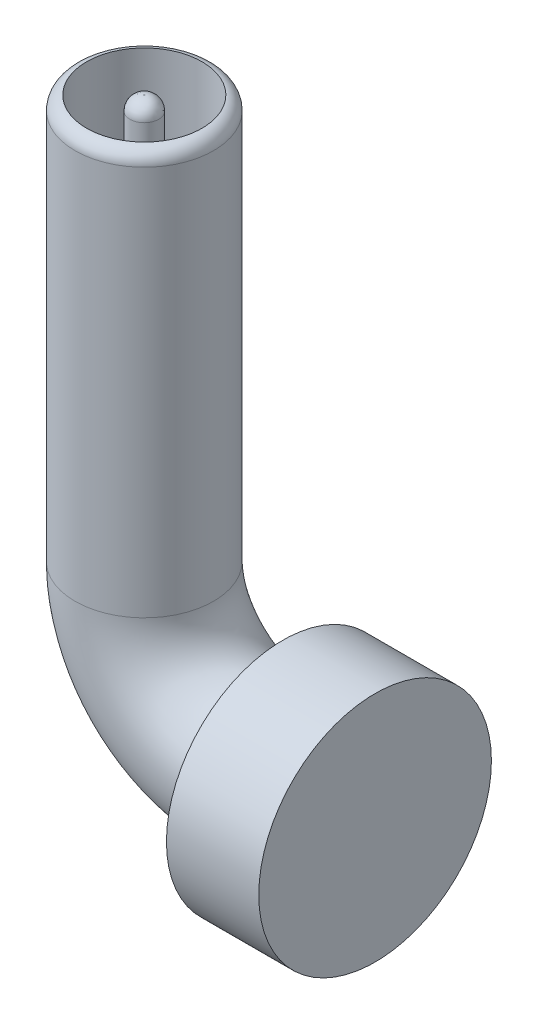
ISO-10303-21;
HEADER;
FILE_DESCRIPTION(('STEP AP214'),'2;1');
FILE_NAME('part.step','',(''),(''),'','','');
FILE_SCHEMA(('AUTOMOTIVE_DESIGN { 1 0 10303 214 1 1 1 1 }'));
ENDSEC;
DATA;
#1=APPLICATION_CONTEXT('core data for automotive mechanical design processes');
#2=APPLICATION_PROTOCOL_DEFINITION('international standard','automotive_design',2000,#1);
#3=PRODUCT_CONTEXT('',#1,'mechanical');
#4=PRODUCT('Part','Part','',(#3));
#5=PRODUCT_RELATED_PRODUCT_CATEGORY('part','',(#4));
#6=PRODUCT_DEFINITION_FORMATION('','',#4);
#7=PRODUCT_DEFINITION_CONTEXT('part definition',#1,'design');
#8=PRODUCT_DEFINITION('design','',#6,#7);
#9=PRODUCT_DEFINITION_SHAPE('','',#8);
#10=(LENGTH_UNIT() NAMED_UNIT(*) SI_UNIT(.MILLI.,.METRE.));
#11=(NAMED_UNIT(*) PLANE_ANGLE_UNIT() SI_UNIT($,.RADIAN.));
#12=(NAMED_UNIT(*) SI_UNIT($,.STERADIAN.) SOLID_ANGLE_UNIT());
#13=UNCERTAINTY_MEASURE_WITH_UNIT(LENGTH_MEASURE(1.E-05),#10,'distance_accuracy_value','');
#14=(GEOMETRIC_REPRESENTATION_CONTEXT(3) GLOBAL_UNCERTAINTY_ASSIGNED_CONTEXT((#13)) GLOBAL_UNIT_ASSIGNED_CONTEXT((#10,
#11,#12)) REPRESENTATION_CONTEXT('',''));
#15=CARTESIAN_POINT('',(0.,0.,0.));
#16=DIRECTION('',(0.,0.,1.));
#17=DIRECTION('',(1.,0.,0.));
#18=AXIS2_PLACEMENT_3D('',#15,#16,#17);
#19=CARTESIAN_POINT('',(-12.7,28.575,0.));
#20=DIRECTION('',(0.,-1.,0.));
#21=DIRECTION('',(1.,0.,0.));
#22=AXIS2_PLACEMENT_3D('',#19,#20,#21);
#23=PLANE('',#22);
#24=CARTESIAN_POINT('',(-12.7,28.575,0.));
#25=DIRECTION('',(0.,-1.,0.));
#26=DIRECTION('',(1.,0.,0.));
#27=AXIS2_PLACEMENT_3D('',#24,#25,#26);
#28=CIRCLE('',#27,0.0317500000000005);
#29=CARTESIAN_POINT('',(-12.66825,28.575,0.));
#30=VERTEX_POINT('',#29);
#31=CARTESIAN_POINT('',(-12.73175,28.575,0.));
#32=VERTEX_POINT('',#31);
#33=EDGE_CURVE('E34',#30,#32,#28,.T.);
#34=ORIENTED_EDGE('',*,*,#33,.F.);
#35=CARTESIAN_POINT('',(-12.7,28.575,0.));
#36=DIRECTION('',(0.,-1.,0.));
#37=DIRECTION('',(-1.,0.,0.));
#38=AXIS2_PLACEMENT_3D('',#35,#36,#37);
#39=CIRCLE('',#38,0.0317499999999953);
#40=EDGE_CURVE('E40',#32,#30,#39,.T.);
#41=ORIENTED_EDGE('',*,*,#40,.F.);
#42=EDGE_LOOP('',(#34,#41));
#43=FACE_BOUND('',#42,.T.);
#44=ADVANCED_FACE('F17',(#43),#23,.F.);
#45=CARTESIAN_POINT('',(-12.66825,27.813,0.));
#46=DIRECTION('',(0.,0.,1.));
#47=DIRECTION('',(1.,0.,0.));
#48=AXIS2_PLACEMENT_3D('',#45,#46,#47);
#49=CIRCLE('',#48,0.762);
#50=TRIMMED_CURVE('',#49,(PARAMETER_VALUE(-1.61247505921747)),
(PARAMETER_VALUE(1.61247505921747)),.T.,.PARAMETER.);
#51=CARTESIAN_POINT('',(-12.7,27.813,0.));
#52=DIRECTION('',(0.,-1.,0.));
#53=AXIS1_PLACEMENT('',#51,#52);
#54=SURFACE_OF_REVOLUTION('',#50,#53);
#55=ORIENTED_EDGE('',*,*,#33,.T.);
#56=ORIENTED_EDGE('',*,*,#40,.T.);
#57=EDGE_LOOP('',(#55,#56));
#58=FACE_BOUND('',#57,.T.);
#59=CARTESIAN_POINT('',(-12.7,27.813,0.));
#60=DIRECTION('',(0.,1.,0.));
#61=DIRECTION('',(-1.,0.,0.));
#62=AXIS2_PLACEMENT_3D('',#59,#60,#61);
#63=CIRCLE('',#62,0.793749999999999);
#64=CARTESIAN_POINT('',(-13.49375,27.813,0.));
#65=VERTEX_POINT('',#64);
#66=EDGE_CURVE('E44',#65,#65,#63,.F.);
#67=ORIENTED_EDGE('',*,*,#66,.F.);
#68=EDGE_LOOP('',(#67));
#69=FACE_BOUND('',#68,.T.);
#70=ADVANCED_FACE('F38',(#58,#69),#54,.F.);
#71=CARTESIAN_POINT('',(0.,0.,0.));
#72=DIRECTION('',(1.,0.,0.));
#73=DIRECTION('',(0.,0.,-1.));
#74=AXIS2_PLACEMENT_3D('',#71,#72,#73);
#75=PLANE('',#74);
#76=CARTESIAN_POINT('',(0.,0.,0.));
#77=DIRECTION('',(1.,0.,0.));
#78=DIRECTION('',(0.,0.,-1.));
#79=AXIS2_PLACEMENT_3D('',#76,#77,#78);
#80=CIRCLE('',#79,6.40181661571805);
#81=CARTESIAN_POINT('',(0.,0.,-6.40181661571805));
#82=VERTEX_POINT('',#81);
#83=EDGE_CURVE('E80',#82,#82,#80,.F.);
#84=ORIENTED_EDGE('',*,*,#83,.F.);
#85=EDGE_LOOP('',(#84));
#86=FACE_BOUND('',#85,.T.);
#87=ADVANCED_FACE('F71',(#86),#75,.T.);
#88=CARTESIAN_POINT('',(-12.7,15.875,0.));
#89=DIRECTION('',(0.,1.,0.));
#90=DIRECTION('',(-1.,0.,0.));
#91=AXIS2_PLACEMENT_3D('',#88,#89,#90);
#92=CYLINDRICAL_SURFACE('',#91,0.793749999999999);
#93=CARTESIAN_POINT('',(-12.7,15.875,0.));
#94=DIRECTION('',(0.,1.,0.));
#95=DIRECTION('',(-1.,0.,0.));
#96=AXIS2_PLACEMENT_3D('',#93,#94,#95);
#97=CIRCLE('',#96,0.793749999999999);
#98=CARTESIAN_POINT('',(-13.49375,15.875,0.));
#99=VERTEX_POINT('',#98);
#100=EDGE_CURVE('E84',#99,#99,#97,.F.);
#101=ORIENTED_EDGE('',*,*,#100,.F.);
#102=EDGE_LOOP('',(#101));
#103=FACE_BOUND('',#102,.T.);
#104=ORIENTED_EDGE('',*,*,#66,.T.);
#105=EDGE_LOOP('',(#104));
#106=FACE_BOUND('',#105,.T.);
#107=ADVANCED_FACE('F134',(#103,#106),#92,.T.);
#108=CARTESIAN_POINT('',(-5.08,0.,0.));
#109=DIRECTION('',(1.,0.,0.));
#110=DIRECTION('',(0.,0.,-1.));
#111=AXIS2_PLACEMENT_3D('',#108,#109,#110);
#112=CYLINDRICAL_SURFACE('',#111,6.40181661571805);
#113=ORIENTED_EDGE('',*,*,#83,.T.);
#114=EDGE_LOOP('',(#113));
#115=FACE_BOUND('',#114,.T.);
#116=CARTESIAN_POINT('',(-5.08,0.,0.));
#117=DIRECTION('',(1.,0.,0.));
#118=DIRECTION('',(0.,0.,-1.));
#119=AXIS2_PLACEMENT_3D('',#116,#117,#118);
#120=CIRCLE('',#119,6.40181661571805);
#121=CARTESIAN_POINT('',(-5.08,0.,-6.40181661571805));
#122=VERTEX_POINT('',#121);
#123=EDGE_CURVE('E88',#122,#122,#120,.T.);
#124=ORIENTED_EDGE('',*,*,#123,.T.);
#125=EDGE_LOOP('',(#124));
#126=FACE_BOUND('',#125,.T.);
#127=ADVANCED_FACE('F132',(#115,#126),#112,.T.);
#128=CARTESIAN_POINT('',(-12.7,15.875,0.));
#129=DIRECTION('',(0.,1.,0.));
#130=DIRECTION('',(-1.,0.,0.));
#131=AXIS2_PLACEMENT_3D('',#128,#129,#130);
#132=PLANE('',#131);
#133=CARTESIAN_POINT('',(-12.7,15.875,0.));
#134=DIRECTION('',(0.,1.,0.));
#135=DIRECTION('',(-1.,0.,0.));
#136=AXIS2_PLACEMENT_3D('',#133,#134,#135);
#137=CIRCLE('',#136,3.175);
#138=CARTESIAN_POINT('',(-15.875,15.875,0.));
#139=VERTEX_POINT('',#138);
#140=EDGE_CURVE('E92',#139,#139,#137,.T.);
#141=ORIENTED_EDGE('',*,*,#140,.T.);
#142=EDGE_LOOP('',(#141));
#143=FACE_BOUND('',#142,.T.);
#144=ORIENTED_EDGE('',*,*,#100,.T.);
#145=EDGE_LOOP('',(#144));
#146=FACE_BOUND('',#145,.T.);
#147=ADVANCED_FACE('F128',(#143,#146),#132,.T.);
#148=CARTESIAN_POINT('',(-5.08,0.,0.));
#149=DIRECTION('',(1.,0.,0.));
#150=DIRECTION('',(0.,0.,-1.));
#151=AXIS2_PLACEMENT_3D('',#148,#149,#150);
#152=PLANE('',#151);
#153=ORIENTED_EDGE('',*,*,#123,.F.);
#154=EDGE_LOOP('',(#153));
#155=FACE_BOUND('',#154,.T.);
#156=CARTESIAN_POINT('',(-5.08,0.,0.));
#157=DIRECTION('',(1.,0.,0.));
#158=DIRECTION('',(0.,1.,0.));
#159=AXIS2_PLACEMENT_3D('',#156,#157,#158);
#160=CIRCLE('',#159,3.81);
#161=CARTESIAN_POINT('',(-5.08,3.81,0.));
#162=VERTEX_POINT('',#161);
#163=EDGE_CURVE('E60',#162,#162,#160,.F.);
#164=ORIENTED_EDGE('',*,*,#163,.F.);
#165=EDGE_LOOP('',(#164));
#166=FACE_BOUND('',#165,.T.);
#167=ADVANCED_FACE('F124',(#155,#166),#152,.F.);
#168=CARTESIAN_POINT('',(-12.7,15.875,0.));
#169=DIRECTION('',(0.,1.,0.));
#170=DIRECTION('',(-1.,0.,0.));
#171=AXIS2_PLACEMENT_3D('',#168,#169,#170);
#172=CYLINDRICAL_SURFACE('',#171,3.175);
#173=ORIENTED_EDGE('',*,*,#140,.F.);
#174=EDGE_LOOP('',(#173));
#175=FACE_BOUND('',#174,.T.);
#176=CARTESIAN_POINT('',(-12.7,28.575,0.));
#177=DIRECTION('',(0.,1.,0.));
#178=DIRECTION('',(-1.,0.,0.));
#179=AXIS2_PLACEMENT_3D('',#176,#177,#178);
#180=CIRCLE('',#179,3.175);
#181=CARTESIAN_POINT('',(-15.875,28.575,0.));
#182=VERTEX_POINT('',#181);
#183=EDGE_CURVE('E97',#182,#182,#180,.F.);
#184=ORIENTED_EDGE('',*,*,#183,.F.);
#185=EDGE_LOOP('',(#184));
#186=FACE_BOUND('',#185,.T.);
#187=ADVANCED_FACE('F121',(#175,#186),#172,.F.);
#188=CARTESIAN_POINT('',(-6.35,0.,0.));
#189=DIRECTION('',(1.,0.,0.));
#190=DIRECTION('',(0.,1.,0.));
#191=AXIS2_PLACEMENT_3D('',#188,#189,#190);
#192=CYLINDRICAL_SURFACE('',#191,3.81);
#193=ORIENTED_EDGE('',*,*,#163,.T.);
#194=EDGE_LOOP('',(#193));
#195=FACE_BOUND('',#194,.T.);
#196=CARTESIAN_POINT('',(-6.35,0.,0.));
#197=DIRECTION('',(-1.,0.,0.));
#198=DIRECTION('',(0.,-1.,0.));
#199=AXIS2_PLACEMENT_3D('',#196,#197,#198);
#200=CIRCLE('',#199,3.81);
#201=CARTESIAN_POINT('',(-6.35,-3.81,0.));
#202=VERTEX_POINT('',#201);
#203=EDGE_CURVE('E101',#202,#202,#200,.T.);
#204=ORIENTED_EDGE('',*,*,#203,.F.);
#205=EDGE_LOOP('',(#204));
#206=FACE_BOUND('',#205,.T.);
#207=ADVANCED_FACE('F117',(#195,#206),#192,.T.);
#208=CARTESIAN_POINT('',(-12.7,27.8236578675463,0.));
#209=DIRECTION('',(0.,1.,0.));
#210=DIRECTION('',(-1.,0.,0.));
#211=AXIS2_PLACEMENT_3D('',#208,#209,#210);
#212=TOROIDAL_SURFACE('',#211,3.048,0.762);
#213=ORIENTED_EDGE('',*,*,#183,.T.);
#214=EDGE_LOOP('',(#213));
#215=FACE_BOUND('',#214,.T.);
#216=CARTESIAN_POINT('',(-12.7,27.8236578675463,0.));
#217=DIRECTION('',(0.,1.,0.));
#218=DIRECTION('',(0.,0.,1.));
#219=AXIS2_PLACEMENT_3D('',#216,#217,#218);
#220=CIRCLE('',#219,3.81);
#221=CARTESIAN_POINT('',(-12.7,27.8236578675463,3.81));
#222=VERTEX_POINT('',#221);
#223=EDGE_CURVE('E11',#222,#222,#220,.F.);
#224=ORIENTED_EDGE('',*,*,#223,.F.);
#225=EDGE_LOOP('',(#224));
#226=FACE_BOUND('',#225,.T.);
#227=ADVANCED_FACE('F112',(#215,#226),#212,.T.);
#228=CARTESIAN_POINT('',(-6.35,6.35,0.));
#229=DIRECTION('',(0.,0.,-1.));
#230=DIRECTION('',(-1.,0.,0.));
#231=AXIS2_PLACEMENT_3D('',#228,#229,#230);
#232=TOROIDAL_SURFACE('',#231,6.35,3.81);
#233=ORIENTED_EDGE('',*,*,#203,.T.);
#234=EDGE_LOOP('',(#233));
#235=FACE_BOUND('',#234,.T.);
#236=CARTESIAN_POINT('',(-12.7,6.35,0.));
#237=DIRECTION('',(0.,1.,0.));
#238=DIRECTION('',(0.,0.,1.));
#239=AXIS2_PLACEMENT_3D('',#236,#237,#238);
#240=CIRCLE('',#239,3.81);
#241=CARTESIAN_POINT('',(-12.7,6.35,3.81));
#242=VERTEX_POINT('',#241);
#243=EDGE_CURVE('E27',#242,#242,#240,.T.);
#244=ORIENTED_EDGE('',*,*,#243,.F.);
#245=EDGE_LOOP('',(#244));
#246=FACE_BOUND('',#245,.T.);
#247=ADVANCED_FACE('F116',(#235,#246),#232,.T.);
#248=CARTESIAN_POINT('',(-12.7,6.35,0.));
#249=DIRECTION('',(0.,1.,0.));
#250=DIRECTION('',(0.,0.,1.));
#251=AXIS2_PLACEMENT_3D('',#248,#249,#250);
#252=CYLINDRICAL_SURFACE('',#251,3.81);
#253=ORIENTED_EDGE('',*,*,#223,.T.);
#254=EDGE_LOOP('',(#253));
#255=FACE_BOUND('',#254,.T.);
#256=ORIENTED_EDGE('',*,*,#243,.T.);
#257=EDGE_LOOP('',(#256));
#258=FACE_BOUND('',#257,.T.);
#259=ADVANCED_FACE('F143',(#255,#258),#252,.T.);
#260=CLOSED_SHELL('',(#44,#70,#87,#107,#127,#147,#167,#187,#207,#227,#247,#259));
#261=MANIFOLD_SOLID_BREP('B1',#260);
#262=ADVANCED_BREP_SHAPE_REPRESENTATION('',(#18,#261),#14);
#263=SHAPE_DEFINITION_REPRESENTATION(#9,#262);
ENDSEC;
END-ISO-10303-21;
